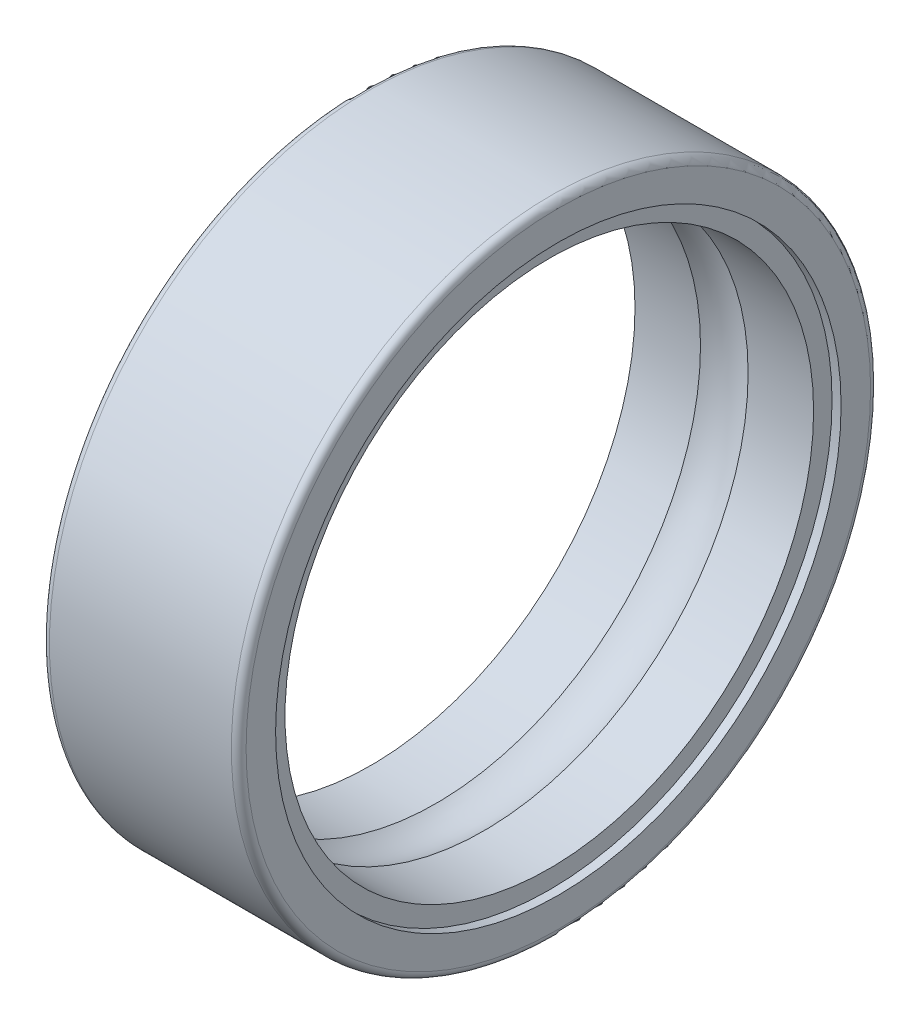
ISO-10303-21;
HEADER;
FILE_DESCRIPTION(('STEP AP214'),'2;1');
FILE_NAME('part.step','',(''),(''),'','','');
FILE_SCHEMA(('AUTOMOTIVE_DESIGN { 1 0 10303 214 1 1 1 1 }'));
ENDSEC;
DATA;
#1=APPLICATION_CONTEXT('core data for automotive mechanical design processes');
#2=APPLICATION_PROTOCOL_DEFINITION('international standard','automotive_design',2000,#1);
#3=PRODUCT_CONTEXT('',#1,'mechanical');
#4=PRODUCT('Part','Part','',(#3));
#5=PRODUCT_RELATED_PRODUCT_CATEGORY('part','',(#4));
#6=PRODUCT_DEFINITION_FORMATION('','',#4);
#7=PRODUCT_DEFINITION_CONTEXT('part definition',#1,'design');
#8=PRODUCT_DEFINITION('design','',#6,#7);
#9=PRODUCT_DEFINITION_SHAPE('','',#8);
#10=(LENGTH_UNIT() NAMED_UNIT(*) SI_UNIT(.MILLI.,.METRE.));
#11=(NAMED_UNIT(*) PLANE_ANGLE_UNIT() SI_UNIT($,.RADIAN.));
#12=(NAMED_UNIT(*) SI_UNIT($,.STERADIAN.) SOLID_ANGLE_UNIT());
#13=UNCERTAINTY_MEASURE_WITH_UNIT(LENGTH_MEASURE(1.E-05),#10,'distance_accuracy_value','');
#14=(GEOMETRIC_REPRESENTATION_CONTEXT(3) GLOBAL_UNCERTAINTY_ASSIGNED_CONTEXT((#13)) GLOBAL_UNIT_ASSIGNED_CONTEXT((#10,
#11,#12)) REPRESENTATION_CONTEXT('',''));
#15=CARTESIAN_POINT('',(0.,0.,0.));
#16=DIRECTION('',(0.,0.,1.));
#17=DIRECTION('',(1.,0.,0.));
#18=AXIS2_PLACEMENT_3D('',#15,#16,#17);
#19=CARTESIAN_POINT('',(4.,0.,0.));
#20=DIRECTION('',(1.,0.,0.));
#21=DIRECTION('',(0.,0.,-1.));
#22=AXIS2_PLACEMENT_3D('',#19,#20,#21);
#23=TOROIDAL_SURFACE('',#22,8.99999999999983,2.00000000000017);
#24=CARTESIAN_POINT('',(4.9682458365519,0.,0.));
#25=DIRECTION('',(1.,0.,0.));
#26=DIRECTION('',(0.,0.,-1.));
#27=AXIS2_PLACEMENT_3D('',#24,#25,#26);
#28=CIRCLE('',#27,10.75);
#29=CARTESIAN_POINT('',(4.9682458365519,0.,-10.75));
#30=VERTEX_POINT('',#29);
#31=EDGE_CURVE('E139',#30,#30,#28,.T.);
#32=ORIENTED_EDGE('',*,*,#31,.T.);
#33=EDGE_LOOP('',(#32));
#34=FACE_BOUND('',#33,.T.);
#35=CARTESIAN_POINT('',(3.0317541634481,0.,0.));
#36=DIRECTION('',(1.,0.,0.));
#37=DIRECTION('',(0.,0.,-1.));
#38=AXIS2_PLACEMENT_3D('',#35,#36,#37);
#39=CIRCLE('',#38,10.75);
#40=CARTESIAN_POINT('',(3.0317541634481,0.,-10.75));
#41=VERTEX_POINT('',#40);
#42=EDGE_CURVE('E137',#41,#41,#39,.F.);
#43=ORIENTED_EDGE('',*,*,#42,.T.);
#44=EDGE_LOOP('',(#43));
#45=FACE_BOUND('',#44,.T.);
#46=ADVANCED_FACE('F15',(#34,#45),#23,.F.);
#47=CARTESIAN_POINT('',(6.30012291827595,0.,0.));
#48=DIRECTION('',(1.,0.,0.));
#49=DIRECTION('',(0.,0.,-1.));
#50=AXIS2_PLACEMENT_3D('',#47,#48,#49);
#51=CYLINDRICAL_SURFACE('',#50,10.75);
#52=CARTESIAN_POINT('',(7.632,0.,0.));
#53=DIRECTION('',(1.,0.,0.));
#54=DIRECTION('',(0.,0.,-1.));
#55=AXIS2_PLACEMENT_3D('',#52,#53,#54);
#56=CIRCLE('',#55,10.75);
#57=CARTESIAN_POINT('',(7.632,0.,-10.75));
#58=VERTEX_POINT('',#57);
#59=EDGE_CURVE('E19',#58,#58,#56,.F.);
#60=ORIENTED_EDGE('',*,*,#59,.F.);
#61=EDGE_LOOP('',(#60));
#62=FACE_BOUND('',#61,.T.);
#63=ORIENTED_EDGE('',*,*,#31,.F.);
#64=EDGE_LOOP('',(#63));
#65=FACE_BOUND('',#64,.T.);
#66=ADVANCED_FACE('F98',(#62,#65),#51,.F.);
#67=CARTESIAN_POINT('',(1.69987708172405,0.,0.));
#68=DIRECTION('',(1.,0.,0.));
#69=DIRECTION('',(0.,0.,-1.));
#70=AXIS2_PLACEMENT_3D('',#67,#68,#69);
#71=CYLINDRICAL_SURFACE('',#70,10.75);
#72=ORIENTED_EDGE('',*,*,#42,.F.);
#73=EDGE_LOOP('',(#72));
#74=FACE_BOUND('',#73,.T.);
#75=CARTESIAN_POINT('',(0.368,0.,0.));
#76=DIRECTION('',(1.,0.,0.));
#77=DIRECTION('',(0.,0.,-1.));
#78=AXIS2_PLACEMENT_3D('',#75,#76,#77);
#79=CIRCLE('',#78,10.75);
#80=CARTESIAN_POINT('',(0.368,0.,-10.75));
#81=VERTEX_POINT('',#80);
#82=EDGE_CURVE('E133',#81,#81,#79,.T.);
#83=ORIENTED_EDGE('',*,*,#82,.F.);
#84=EDGE_LOOP('',(#83));
#85=FACE_BOUND('',#84,.T.);
#86=ADVANCED_FACE('F95',(#74,#85),#71,.F.);
#87=CARTESIAN_POINT('',(7.632,10.75,0.));
#88=DIRECTION('',(1.,0.,0.));
#89=DIRECTION('',(0.,0.,-1.));
#90=AXIS2_PLACEMENT_3D('',#87,#88,#89);
#91=PLANE('',#90);
#92=ORIENTED_EDGE('',*,*,#59,.T.);
#93=EDGE_LOOP('',(#92));
#94=FACE_BOUND('',#93,.T.);
#95=CARTESIAN_POINT('',(7.632,0.,0.));
#96=DIRECTION('',(1.,0.,0.));
#97=DIRECTION('',(0.,0.,-1.));
#98=AXIS2_PLACEMENT_3D('',#95,#96,#97);
#99=CIRCLE('',#98,11.5);
#100=CARTESIAN_POINT('',(7.632,0.,-11.5));
#101=VERTEX_POINT('',#100);
#102=EDGE_CURVE('E131',#101,#101,#99,.T.);
#103=ORIENTED_EDGE('',*,*,#102,.T.);
#104=EDGE_LOOP('',(#103));
#105=FACE_BOUND('',#104,.T.);
#106=ADVANCED_FACE('F91',(#94,#105),#91,.T.);
#107=CARTESIAN_POINT('',(0.368,11.5,0.));
#108=DIRECTION('',(-1.,0.,0.));
#109=DIRECTION('',(0.,0.,1.));
#110=AXIS2_PLACEMENT_3D('',#107,#108,#109);
#111=PLANE('',#110);
#112=ORIENTED_EDGE('',*,*,#82,.T.);
#113=EDGE_LOOP('',(#112));
#114=FACE_BOUND('',#113,.T.);
#115=CARTESIAN_POINT('',(0.368,0.,0.));
#116=DIRECTION('',(1.,0.,0.));
#117=DIRECTION('',(0.,0.,-1.));
#118=AXIS2_PLACEMENT_3D('',#115,#116,#117);
#119=CIRCLE('',#118,11.5);
#120=CARTESIAN_POINT('',(0.368,0.,-11.5));
#121=VERTEX_POINT('',#120);
#122=EDGE_CURVE('E124',#121,#121,#119,.F.);
#123=ORIENTED_EDGE('',*,*,#122,.T.);
#124=EDGE_LOOP('',(#123));
#125=FACE_BOUND('',#124,.T.);
#126=ADVANCED_FACE('F87',(#114,#125),#111,.T.);
#127=CARTESIAN_POINT('',(7.816,0.,0.));
#128=DIRECTION('',(1.,0.,0.));
#129=DIRECTION('',(0.,0.,-1.));
#130=AXIS2_PLACEMENT_3D('',#127,#128,#129);
#131=CYLINDRICAL_SURFACE('',#130,11.5);
#132=CARTESIAN_POINT('',(8.,0.,0.));
#133=DIRECTION('',(1.,0.,0.));
#134=DIRECTION('',(0.,0.,-1.));
#135=AXIS2_PLACEMENT_3D('',#132,#133,#134);
#136=CIRCLE('',#135,11.5);
#137=CARTESIAN_POINT('',(8.,0.,-11.5));
#138=VERTEX_POINT('',#137);
#139=EDGE_CURVE('E119',#138,#138,#136,.F.);
#140=ORIENTED_EDGE('',*,*,#139,.F.);
#141=EDGE_LOOP('',(#140));
#142=FACE_BOUND('',#141,.T.);
#143=ORIENTED_EDGE('',*,*,#102,.F.);
#144=EDGE_LOOP('',(#143));
#145=FACE_BOUND('',#144,.T.);
#146=ADVANCED_FACE('F83',(#142,#145),#131,.F.);
#147=CARTESIAN_POINT('',(0.184,0.,0.));
#148=DIRECTION('',(1.,0.,0.));
#149=DIRECTION('',(0.,0.,-1.));
#150=AXIS2_PLACEMENT_3D('',#147,#148,#149);
#151=CYLINDRICAL_SURFACE('',#150,11.5);
#152=ORIENTED_EDGE('',*,*,#122,.F.);
#153=EDGE_LOOP('',(#152));
#154=FACE_BOUND('',#153,.T.);
#155=CARTESIAN_POINT('',(0.,0.,0.));
#156=DIRECTION('',(1.,0.,0.));
#157=DIRECTION('',(0.,0.,-1.));
#158=AXIS2_PLACEMENT_3D('',#155,#156,#157);
#159=CIRCLE('',#158,11.5);
#160=CARTESIAN_POINT('',(0.,0.,-11.5));
#161=VERTEX_POINT('',#160);
#162=EDGE_CURVE('E117',#161,#161,#159,.T.);
#163=ORIENTED_EDGE('',*,*,#162,.F.);
#164=EDGE_LOOP('',(#163));
#165=FACE_BOUND('',#164,.T.);
#166=ADVANCED_FACE('F78',(#154,#165),#151,.F.);
#167=CARTESIAN_POINT('',(8.,11.5,0.));
#168=DIRECTION('',(1.,0.,0.));
#169=DIRECTION('',(0.,0.,-1.));
#170=AXIS2_PLACEMENT_3D('',#167,#168,#169);
#171=PLANE('',#170);
#172=ORIENTED_EDGE('',*,*,#139,.T.);
#173=EDGE_LOOP('',(#172));
#174=FACE_BOUND('',#173,.T.);
#175=CARTESIAN_POINT('',(8.,0.,0.));
#176=DIRECTION('',(-1.,0.,0.));
#177=DIRECTION('',(0.,0.,1.));
#178=AXIS2_PLACEMENT_3D('',#175,#176,#177);
#179=CIRCLE('',#178,12.7);
#180=CARTESIAN_POINT('',(8.,0.,12.7));
#181=VERTEX_POINT('',#180);
#182=EDGE_CURVE('E62',#181,#181,#179,.T.);
#183=ORIENTED_EDGE('',*,*,#182,.F.);
#184=EDGE_LOOP('',(#183));
#185=FACE_BOUND('',#184,.T.);
#186=ADVANCED_FACE('F68',(#174,#185),#171,.T.);
#187=CARTESIAN_POINT('',(0.,12.7,0.));
#188=DIRECTION('',(-1.,0.,0.));
#189=DIRECTION('',(0.,0.,1.));
#190=AXIS2_PLACEMENT_3D('',#187,#188,#189);
#191=PLANE('',#190);
#192=ORIENTED_EDGE('',*,*,#162,.T.);
#193=EDGE_LOOP('',(#192));
#194=FACE_BOUND('',#193,.T.);
#195=CARTESIAN_POINT('',(0.,0.,0.));
#196=DIRECTION('',(1.,0.,0.));
#197=DIRECTION('',(0.,0.,1.));
#198=AXIS2_PLACEMENT_3D('',#195,#196,#197);
#199=CIRCLE('',#198,12.7);
#200=CARTESIAN_POINT('',(0.,0.,12.7));
#201=VERTEX_POINT('',#200);
#202=EDGE_CURVE('E28',#201,#201,#199,.T.);
#203=ORIENTED_EDGE('',*,*,#202,.F.);
#204=EDGE_LOOP('',(#203));
#205=FACE_BOUND('',#204,.T.);
#206=ADVANCED_FACE('F77',(#194,#205),#191,.T.);
#207=CARTESIAN_POINT('',(7.70000000000012,0.,0.));
#208=DIRECTION('',(1.,0.,0.));
#209=DIRECTION('',(0.,0.,-1.));
#210=AXIS2_PLACEMENT_3D('',#207,#208,#209);
#211=TOROIDAL_SURFACE('',#210,12.7000000000001,0.299999999999876);
#212=CARTESIAN_POINT('',(7.7,0.,0.));
#213=DIRECTION('',(1.,0.,0.));
#214=DIRECTION('',(0.,0.,-1.));
#215=AXIS2_PLACEMENT_3D('',#212,#213,#214);
#216=CIRCLE('',#215,13.);
#217=CARTESIAN_POINT('',(7.7,0.,-13.));
#218=VERTEX_POINT('',#217);
#219=EDGE_CURVE('E23',#218,#218,#216,.F.);
#220=ORIENTED_EDGE('',*,*,#219,.F.);
#221=EDGE_LOOP('',(#220));
#222=FACE_BOUND('',#221,.T.);
#223=ORIENTED_EDGE('',*,*,#182,.T.);
#224=EDGE_LOOP('',(#223));
#225=FACE_BOUND('',#224,.T.);
#226=ADVANCED_FACE('F42',(#222,#225),#211,.T.);
#227=CARTESIAN_POINT('',(0.299999999999938,0.,0.));
#228=DIRECTION('',(1.,0.,0.));
#229=DIRECTION('',(0.,0.,-1.));
#230=AXIS2_PLACEMENT_3D('',#227,#228,#229);
#231=TOROIDAL_SURFACE('',#230,12.7000000000001,0.299999999999938);
#232=ORIENTED_EDGE('',*,*,#202,.T.);
#233=EDGE_LOOP('',(#232));
#234=FACE_BOUND('',#233,.T.);
#235=CARTESIAN_POINT('',(0.3,0.,0.));
#236=DIRECTION('',(1.,0.,0.));
#237=DIRECTION('',(0.,0.,-1.));
#238=AXIS2_PLACEMENT_3D('',#235,#236,#237);
#239=CIRCLE('',#238,13.);
#240=CARTESIAN_POINT('',(0.3,0.,-13.));
#241=VERTEX_POINT('',#240);
#242=EDGE_CURVE('E10',#241,#241,#239,.T.);
#243=ORIENTED_EDGE('',*,*,#242,.F.);
#244=EDGE_LOOP('',(#243));
#245=FACE_BOUND('',#244,.T.);
#246=ADVANCED_FACE('F36',(#234,#245),#231,.T.);
#247=CARTESIAN_POINT('',(4.,0.,0.));
#248=DIRECTION('',(1.,0.,0.));
#249=DIRECTION('',(0.,0.,-1.));
#250=AXIS2_PLACEMENT_3D('',#247,#248,#249);
#251=CYLINDRICAL_SURFACE('',#250,13.);
#252=ORIENTED_EDGE('',*,*,#242,.T.);
#253=EDGE_LOOP('',(#252));
#254=FACE_BOUND('',#253,.T.);
#255=ORIENTED_EDGE('',*,*,#219,.T.);
#256=EDGE_LOOP('',(#255));
#257=FACE_BOUND('',#256,.T.);
#258=ADVANCED_FACE('F41',(#254,#257),#251,.T.);
#259=CLOSED_SHELL('',(#46,#66,#86,#106,#126,#146,#166,#186,#206,#226,#246,#258));
#260=MANIFOLD_SOLID_BREP('B1',#259);
#261=ADVANCED_BREP_SHAPE_REPRESENTATION('',(#18,#260),#14);
#262=SHAPE_DEFINITION_REPRESENTATION(#9,#261);
ENDSEC;
END-ISO-10303-21;
